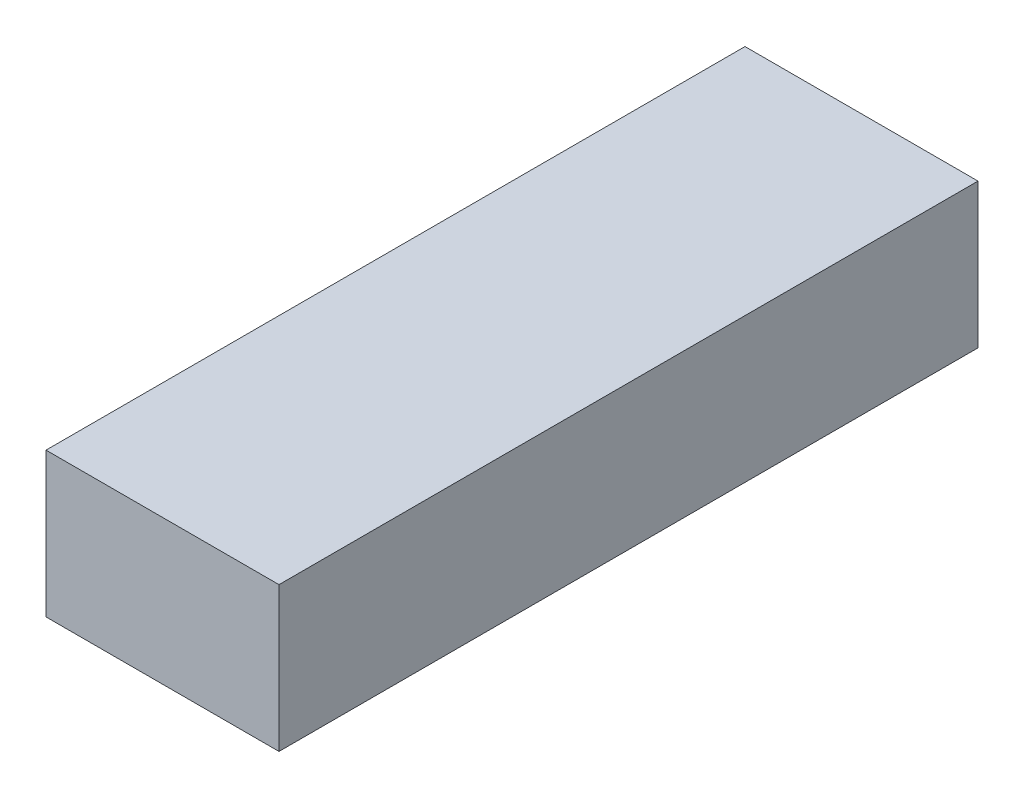
ISO-10303-21;
HEADER;
FILE_DESCRIPTION(('STEP AP214'),'2;1');
FILE_NAME('part.step','',(''),(''),'','','');
FILE_SCHEMA(('AUTOMOTIVE_DESIGN { 1 0 10303 214 1 1 1 1 }'));
ENDSEC;
DATA;
#1=APPLICATION_CONTEXT('core data for automotive mechanical design processes');
#2=APPLICATION_PROTOCOL_DEFINITION('international standard','automotive_design',2000,#1);
#3=PRODUCT_CONTEXT('',#1,'mechanical');
#4=PRODUCT('Part','Part','',(#3));
#5=PRODUCT_RELATED_PRODUCT_CATEGORY('part','',(#4));
#6=PRODUCT_DEFINITION_FORMATION('','',#4);
#7=PRODUCT_DEFINITION_CONTEXT('part definition',#1,'design');
#8=PRODUCT_DEFINITION('design','',#6,#7);
#9=PRODUCT_DEFINITION_SHAPE('','',#8);
#10=(LENGTH_UNIT() NAMED_UNIT(*) SI_UNIT(.MILLI.,.METRE.));
#11=(NAMED_UNIT(*) PLANE_ANGLE_UNIT() SI_UNIT($,.RADIAN.));
#12=(NAMED_UNIT(*) SI_UNIT($,.STERADIAN.) SOLID_ANGLE_UNIT());
#13=UNCERTAINTY_MEASURE_WITH_UNIT(LENGTH_MEASURE(1.E-05),#10,'distance_accuracy_value','');
#14=(GEOMETRIC_REPRESENTATION_CONTEXT(3) GLOBAL_UNCERTAINTY_ASSIGNED_CONTEXT((#13)) GLOBAL_UNIT_ASSIGNED_CONTEXT((#10,
#11,#12)) REPRESENTATION_CONTEXT('',''));
#15=CARTESIAN_POINT('',(0.,0.,0.));
#16=DIRECTION('',(0.,0.,1.));
#17=DIRECTION('',(1.,0.,0.));
#18=AXIS2_PLACEMENT_3D('',#15,#16,#17);
#19=CARTESIAN_POINT('',(-17.5,21.7,0.));
#20=DIRECTION('',(1.,0.,0.));
#21=DIRECTION('',(0.,0.,-1.));
#22=AXIS2_PLACEMENT_3D('',#19,#20,#21);
#23=PLANE('',#22);
#24=DIRECTION('',(0.,0.,1.));
#25=VECTOR('',#24,1.);
#26=CARTESIAN_POINT('',(-17.5,0.,0.));
#27=LINE('',#26,#25);
#28=CARTESIAN_POINT('',(-17.5,0.,-105.));
#29=VERTEX_POINT('',#28);
#30=CARTESIAN_POINT('',(-17.5,0.,0.));
#31=VERTEX_POINT('',#30);
#32=EDGE_CURVE('E95',#29,#31,#27,.T.);
#33=ORIENTED_EDGE('',*,*,#32,.T.);
#34=DIRECTION('',(0.,-1.,0.));
#35=VECTOR('',#34,1.);
#36=CARTESIAN_POINT('',(-17.5,21.7,0.));
#37=LINE('',#36,#35);
#38=CARTESIAN_POINT('',(-17.5,21.7,0.));
#39=VERTEX_POINT('',#38);
#40=EDGE_CURVE('E11',#39,#31,#37,.T.);
#41=ORIENTED_EDGE('',*,*,#40,.F.);
#42=DIRECTION('',(0.,0.,1.));
#43=VECTOR('',#42,1.);
#44=CARTESIAN_POINT('',(-17.5,21.7,0.));
#45=LINE('',#44,#43);
#46=CARTESIAN_POINT('',(-17.5,21.7,-105.));
#47=VERTEX_POINT('',#46);
#48=EDGE_CURVE('E83',#47,#39,#45,.T.);
#49=ORIENTED_EDGE('',*,*,#48,.F.);
#50=DIRECTION('',(0.,-1.,0.));
#51=VECTOR('',#50,1.);
#52=CARTESIAN_POINT('',(-17.5,21.7,-105.));
#53=LINE('',#52,#51);
#54=EDGE_CURVE('E91',#47,#29,#53,.T.);
#55=ORIENTED_EDGE('',*,*,#54,.T.);
#56=EDGE_LOOP('',(#33,#41,#49,#55));
#57=FACE_BOUND('',#56,.T.);
#58=ADVANCED_FACE('F32',(#57),#23,.F.);
#59=CARTESIAN_POINT('',(-17.5,21.7,0.));
#60=DIRECTION('',(0.,0.,-1.));
#61=DIRECTION('',(-1.,0.,0.));
#62=AXIS2_PLACEMENT_3D('',#59,#60,#61);
#63=PLANE('',#62);
#64=DIRECTION('',(1.,0.,0.));
#65=VECTOR('',#64,1.);
#66=CARTESIAN_POINT('',(-17.5,0.,0.));
#67=LINE('',#66,#65);
#68=CARTESIAN_POINT('',(17.5,0.,0.));
#69=VERTEX_POINT('',#68);
#70=EDGE_CURVE('E87',#31,#69,#67,.T.);
#71=ORIENTED_EDGE('',*,*,#70,.T.);
#72=DIRECTION('',(0.,-1.,0.));
#73=VECTOR('',#72,1.);
#74=CARTESIAN_POINT('',(17.5,21.7,0.));
#75=LINE('',#74,#73);
#76=CARTESIAN_POINT('',(17.5,21.7,0.));
#77=VERTEX_POINT('',#76);
#78=EDGE_CURVE('E40',#77,#69,#75,.T.);
#79=ORIENTED_EDGE('',*,*,#78,.F.);
#80=DIRECTION('',(1.,0.,0.));
#81=VECTOR('',#80,1.);
#82=CARTESIAN_POINT('',(-17.5,21.7,0.));
#83=LINE('',#82,#81);
#84=EDGE_CURVE('E78',#39,#77,#83,.T.);
#85=ORIENTED_EDGE('',*,*,#84,.F.);
#86=ORIENTED_EDGE('',*,*,#40,.T.);
#87=EDGE_LOOP('',(#71,#79,#85,#86));
#88=FACE_BOUND('',#87,.T.);
#89=ADVANCED_FACE('F86',(#88),#63,.F.);
#90=CARTESIAN_POINT('',(17.5,21.7,0.));
#91=DIRECTION('',(-1.,0.,0.));
#92=DIRECTION('',(0.,0.,1.));
#93=AXIS2_PLACEMENT_3D('',#90,#91,#92);
#94=PLANE('',#93);
#95=DIRECTION('',(0.,0.,-1.));
#96=VECTOR('',#95,1.);
#97=CARTESIAN_POINT('',(17.5,0.,0.));
#98=LINE('',#97,#96);
#99=CARTESIAN_POINT('',(17.5,0.,-105.));
#100=VERTEX_POINT('',#99);
#101=EDGE_CURVE('E65',#69,#100,#98,.T.);
#102=ORIENTED_EDGE('',*,*,#101,.T.);
#103=DIRECTION('',(0.,-1.,0.));
#104=VECTOR('',#103,1.);
#105=CARTESIAN_POINT('',(17.5,21.7,-105.));
#106=LINE('',#105,#104);
#107=CARTESIAN_POINT('',(17.5,21.7,-105.));
#108=VERTEX_POINT('',#107);
#109=EDGE_CURVE('E88',#108,#100,#106,.T.);
#110=ORIENTED_EDGE('',*,*,#109,.F.);
#111=DIRECTION('',(0.,0.,-1.));
#112=VECTOR('',#111,1.);
#113=CARTESIAN_POINT('',(17.5,21.7,0.));
#114=LINE('',#113,#112);
#115=EDGE_CURVE('E81',#77,#108,#114,.T.);
#116=ORIENTED_EDGE('',*,*,#115,.F.);
#117=ORIENTED_EDGE('',*,*,#78,.T.);
#118=EDGE_LOOP('',(#102,#110,#116,#117));
#119=FACE_BOUND('',#118,.T.);
#120=ADVANCED_FACE('F89',(#119),#94,.F.);
#121=CARTESIAN_POINT('',(-17.5,21.7,-105.));
#122=DIRECTION('',(0.,0.,1.));
#123=DIRECTION('',(1.,0.,0.));
#124=AXIS2_PLACEMENT_3D('',#121,#122,#123);
#125=PLANE('',#124);
#126=DIRECTION('',(-1.,0.,0.));
#127=VECTOR('',#126,1.);
#128=CARTESIAN_POINT('',(-17.5,0.,-105.));
#129=LINE('',#128,#127);
#130=EDGE_CURVE('E71',#100,#29,#129,.T.);
#131=ORIENTED_EDGE('',*,*,#130,.T.);
#132=ORIENTED_EDGE('',*,*,#54,.F.);
#133=DIRECTION('',(-1.,0.,0.));
#134=VECTOR('',#133,1.);
#135=CARTESIAN_POINT('',(-17.5,21.7,-105.));
#136=LINE('',#135,#134);
#137=EDGE_CURVE('E48',#108,#47,#136,.T.);
#138=ORIENTED_EDGE('',*,*,#137,.F.);
#139=ORIENTED_EDGE('',*,*,#109,.T.);
#140=EDGE_LOOP('',(#131,#132,#138,#139));
#141=FACE_BOUND('',#140,.T.);
#142=ADVANCED_FACE('F102',(#141),#125,.F.);
#143=CARTESIAN_POINT('',(0.,21.7,0.));
#144=DIRECTION('',(0.,-1.,0.));
#145=DIRECTION('',(0.,0.,-1.));
#146=AXIS2_PLACEMENT_3D('',#143,#144,#145);
#147=PLANE('',#146);
#148=ORIENTED_EDGE('',*,*,#48,.T.);
#149=ORIENTED_EDGE('',*,*,#84,.T.);
#150=ORIENTED_EDGE('',*,*,#115,.T.);
#151=ORIENTED_EDGE('',*,*,#137,.T.);
#152=EDGE_LOOP('',(#148,#149,#150,#151));
#153=FACE_BOUND('',#152,.T.);
#154=ADVANCED_FACE('F79',(#153),#147,.F.);
#155=CARTESIAN_POINT('',(0.,0.,0.));
#156=DIRECTION('',(0.,-1.,0.));
#157=DIRECTION('',(0.,0.,-1.));
#158=AXIS2_PLACEMENT_3D('',#155,#156,#157);
#159=PLANE('',#158);
#160=ORIENTED_EDGE('',*,*,#32,.F.);
#161=ORIENTED_EDGE('',*,*,#130,.F.);
#162=ORIENTED_EDGE('',*,*,#101,.F.);
#163=ORIENTED_EDGE('',*,*,#70,.F.);
#164=EDGE_LOOP('',(#160,#161,#162,#163));
#165=FACE_BOUND('',#164,.T.);
#166=ADVANCED_FACE('F105',(#165),#159,.T.);
#167=CLOSED_SHELL('',(#58,#89,#120,#142,#154,#166));
#168=MANIFOLD_SOLID_BREP('B2',#167);
#169=ADVANCED_BREP_SHAPE_REPRESENTATION('',(#18,#168),#14);
#170=SHAPE_DEFINITION_REPRESENTATION(#9,#169);
ENDSEC;
END-ISO-10303-21;
